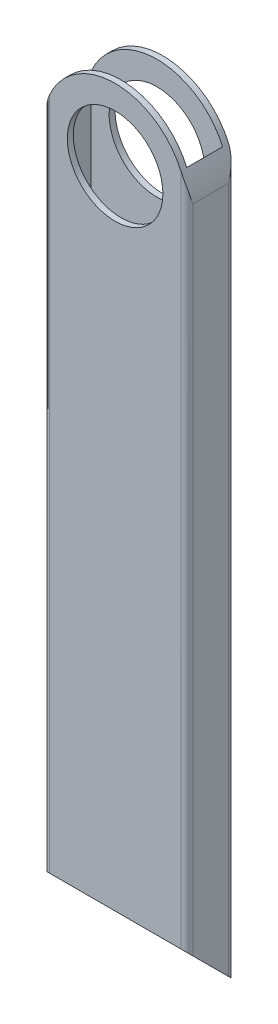
ISO-10303-21;
HEADER;
FILE_DESCRIPTION(('STEP AP214'),'2;1');
FILE_NAME('part.step','',(''),(''),'','','');
FILE_SCHEMA(('AUTOMOTIVE_DESIGN { 1 0 10303 214 1 1 1 1 }'));
ENDSEC;
DATA;
#1=APPLICATION_CONTEXT('core data for automotive mechanical design processes');
#2=APPLICATION_PROTOCOL_DEFINITION('international standard','automotive_design',2000,#1);
#3=PRODUCT_CONTEXT('',#1,'mechanical');
#4=PRODUCT('Part','Part','',(#3));
#5=PRODUCT_RELATED_PRODUCT_CATEGORY('part','',(#4));
#6=PRODUCT_DEFINITION_FORMATION('','',#4);
#7=PRODUCT_DEFINITION_CONTEXT('part definition',#1,'design');
#8=PRODUCT_DEFINITION('design','',#6,#7);
#9=PRODUCT_DEFINITION_SHAPE('','',#8);
#10=(LENGTH_UNIT() NAMED_UNIT(*) SI_UNIT(.MILLI.,.METRE.));
#11=(NAMED_UNIT(*) PLANE_ANGLE_UNIT() SI_UNIT($,.RADIAN.));
#12=(NAMED_UNIT(*) SI_UNIT($,.STERADIAN.) SOLID_ANGLE_UNIT());
#13=UNCERTAINTY_MEASURE_WITH_UNIT(LENGTH_MEASURE(1.E-05),#10,'distance_accuracy_value','');
#14=(GEOMETRIC_REPRESENTATION_CONTEXT(3) GLOBAL_UNCERTAINTY_ASSIGNED_CONTEXT((#13)) GLOBAL_UNIT_ASSIGNED_CONTEXT((#10,
#11,#12)) REPRESENTATION_CONTEXT('',''));
#15=CARTESIAN_POINT('',(0.,0.,0.));
#16=DIRECTION('',(0.,0.,1.));
#17=DIRECTION('',(1.,0.,0.));
#18=AXIS2_PLACEMENT_3D('',#15,#16,#17);
#19=CARTESIAN_POINT('',(38.1,203.2,-1.58750000000001));
#20=DIRECTION('',(-1.,0.,0.));
#21=DIRECTION('',(0.,0.,1.));
#22=AXIS2_PLACEMENT_3D('',#19,#20,#21);
#23=PLANE('',#22);
#24=DIRECTION('',(0.,-1.,0.));
#25=VECTOR('',#24,1.);
#26=CARTESIAN_POINT('',(38.1,203.2,-1.58750000000001));
#27=LINE('',#26,#25);
#28=CARTESIAN_POINT('',(38.1,184.15,-1.58750000000001));
#29=VERTEX_POINT('',#28);
#30=CARTESIAN_POINT('',(38.1,11.1125,-1.58749999999999));
#31=VERTEX_POINT('',#30);
#32=EDGE_CURVE('E162',#29,#31,#27,.T.);
#33=ORIENTED_EDGE('',*,*,#32,.T.);
#34=DIRECTION('',(0.,0.707106781186547,0.707106781186547));
#35=VECTOR('',#34,1.);
#36=CARTESIAN_POINT('',(38.1,0.,-12.7));
#37=LINE('',#36,#35);
#38=CARTESIAN_POINT('',(38.1,1.58750000000002,-11.1125));
#39=VERTEX_POINT('',#38);
#40=EDGE_CURVE('E305',#39,#31,#37,.T.);
#41=ORIENTED_EDGE('',*,*,#40,.F.);
#42=DIRECTION('',(0.,-1.,0.));
#43=VECTOR('',#42,1.);
#44=CARTESIAN_POINT('',(38.1,203.2,-11.1125));
#45=LINE('',#44,#43);
#46=CARTESIAN_POINT('',(38.1,184.15,-11.1125));
#47=VERTEX_POINT('',#46);
#48=EDGE_CURVE('E159',#47,#39,#45,.T.);
#49=ORIENTED_EDGE('',*,*,#48,.F.);
#50=DIRECTION('',(0.,0.,1.));
#51=VECTOR('',#50,1.);
#52=CARTESIAN_POINT('',(38.1,184.15,-12.7));
#53=LINE('',#52,#51);
#54=EDGE_CURVE('E279',#47,#29,#53,.T.);
#55=ORIENTED_EDGE('',*,*,#54,.T.);
#56=EDGE_LOOP('',(#33,#41,#49,#55));
#57=FACE_BOUND('',#56,.T.);
#58=ADVANCED_FACE('F34',(#57),#23,.F.);
#59=CARTESIAN_POINT('',(1.5875,203.2,-1.5875));
#60=DIRECTION('',(0.,-1.,0.));
#61=DIRECTION('',(0.,0.,-1.));
#62=AXIS2_PLACEMENT_3D('',#59,#60,#61);
#63=CYLINDRICAL_SURFACE('',#62,1.5875);
#64=DIRECTION('',(0.,-1.,0.));
#65=VECTOR('',#64,1.);
#66=CARTESIAN_POINT('',(0.,203.2,-1.58750000000001));
#67=LINE('',#66,#65);
#68=CARTESIAN_POINT('',(0.,184.15,-1.58750000000001));
#69=VERTEX_POINT('',#68);
#70=CARTESIAN_POINT('',(0.,11.1125,-1.5875));
#71=VERTEX_POINT('',#70);
#72=EDGE_CURVE('E147',#69,#71,#67,.T.);
#73=ORIENTED_EDGE('',*,*,#72,.T.);
#74=CARTESIAN_POINT('',(1.5875,11.1125,-1.5875));
#75=DIRECTION('',(0.,0.707106781186547,-0.707106781186547));
#76=DIRECTION('',(0.,-0.707106781186548,-0.707106781186548));
#77=AXIS2_PLACEMENT_3D('',#74,#75,#76);
#78=ELLIPSE('',#77,2.24506403026729,1.5875);
#79=CARTESIAN_POINT('',(1.58750000000001,12.7,0.));
#80=VERTEX_POINT('',#79);
#81=EDGE_CURVE('E50',#71,#80,#78,.T.);
#82=ORIENTED_EDGE('',*,*,#81,.T.);
#83=DIRECTION('',(0.,-1.,0.));
#84=VECTOR('',#83,1.);
#85=CARTESIAN_POINT('',(1.58750000000001,203.2,0.));
#86=LINE('',#85,#84);
#87=CARTESIAN_POINT('',(1.58750000000002,191.763382543259,0.));
#88=VERTEX_POINT('',#87);
#89=EDGE_CURVE('E168',#88,#80,#86,.T.);
#90=ORIENTED_EDGE('',*,*,#89,.F.);
#91=CARTESIAN_POINT('',(1.58750000000001,191.763382543259,0.));
#92=CARTESIAN_POINT('',(1.53376495818065,191.640138054539,-2.20127923181103E-05));
#93=CARTESIAN_POINT('',(1.48134884645403,191.51634677516,-0.00272721132376271));
#94=CARTESIAN_POINT('',(1.37922786128263,191.267887621081,-0.0128799698743036));
#95=CARTESIAN_POINT('',(1.32952209970535,191.143220048827,-0.0203259661579967));
#96=CARTESIAN_POINT('',(1.23293387376192,190.89333572705,-0.0393225552435428));
#97=CARTESIAN_POINT('',(1.18604719292055,190.768120114201,-0.0508668302049982));
#98=CARTESIAN_POINT('',(1.09503442027229,190.517067046557,-0.0775720070496662));
#99=CARTESIAN_POINT('',(1.05090859046153,190.391229533965,-0.0927332515169016));
#100=CARTESIAN_POINT('',(0.922969308448521,190.013760253545,-0.142875404943637));
#101=CARTESIAN_POINT('',(0.843273956192606,189.761342510137,-0.182583715714911));
#102=CARTESIAN_POINT('',(0.6948497185621,189.254962806347,-0.271890436384124));
#103=CARTESIAN_POINT('',(0.626126547519453,189.001000112359,-0.321493969678617));
#104=CARTESIAN_POINT('',(0.468855854744227,188.368445417287,-0.454385852694657));
#105=CARTESIAN_POINT('',(0.386872114640803,187.989180843358,-0.542339283056971));
#106=CARTESIAN_POINT('',(0.246538562115965,187.229249942017,-0.729781658305805));
#107=CARTESIAN_POINT('',(0.188193053211932,186.848583372079,-0.829272699464008));
#108=CARTESIAN_POINT('',(0.0480466292446869,185.704992539106,-1.1386101903998));
#109=CARTESIAN_POINT('',(0.00108140591264894,184.940255978614,-1.35937271393351));
#110=CARTESIAN_POINT('',(6.15744997773057E-06,184.167680800396,-1.58239601360152));
#111=CARTESIAN_POINT('',(3.88492361050782E-09,184.158840330417,-1.58494803783133));
#112=CARTESIAN_POINT('',(0.,184.15,-1.5875));
#113=B_SPLINE_CURVE_WITH_KNOTS('',3,(#91,#92,#93,#94,#95,#96,#97,#98,#99,#100,#101,#102,#103,
#104,#105,#106,#107,#108,#109,#110,#111,#112),.UNSPECIFIED.,.F.,.F.,(4,2,2,2,2,2,2,2,2,2,4),(0.,
0.403276855841871,0.806420761100367,1.20894586583019,1.6115091111792,2.41396604086429,
3.21683953784447,4.40933258199479,5.60204263099948,7.98676642553446,8.0143707791923),.UNSPECIFIED.);
#114=EDGE_CURVE('E200',#88,#69,#113,.T.);
#115=ORIENTED_EDGE('',*,*,#114,.T.);
#116=EDGE_LOOP('',(#73,#82,#90,#115));
#117=FACE_BOUND('',#116,.T.);
#118=ADVANCED_FACE('F36',(#117),#63,.T.);
#119=CARTESIAN_POINT('',(1.58750000000001,203.2,0.));
#120=DIRECTION('',(0.,0.,-1.));
#121=DIRECTION('',(-1.,0.,0.));
#122=AXIS2_PLACEMENT_3D('',#119,#120,#121);
#123=PLANE('',#122);
#124=CARTESIAN_POINT('',(19.05,184.15,0.));
#125=DIRECTION('',(0.,0.,1.));
#126=DIRECTION('',(1.,0.,0.));
#127=AXIS2_PLACEMENT_3D('',#124,#125,#126);
#128=CIRCLE('',#127,12.7);
#129=CARTESIAN_POINT('',(31.75,184.15,0.));
#130=VERTEX_POINT('',#129);
#131=EDGE_CURVE('E263',#130,#130,#128,.T.);
#132=ORIENTED_EDGE('',*,*,#131,.F.);
#133=EDGE_LOOP('',(#132));
#134=FACE_BOUND('',#133,.T.);
#135=ORIENTED_EDGE('',*,*,#89,.T.);
#136=DIRECTION('',(1.,0.,0.));
#137=VECTOR('',#136,1.);
#138=CARTESIAN_POINT('',(0.,12.7,0.));
#139=LINE('',#138,#137);
#140=CARTESIAN_POINT('',(36.5125,12.7,0.));
#141=VERTEX_POINT('',#140);
#142=EDGE_CURVE('E267',#80,#141,#139,.T.);
#143=ORIENTED_EDGE('',*,*,#142,.T.);
#144=DIRECTION('',(0.,-1.,0.));
#145=VECTOR('',#144,1.);
#146=CARTESIAN_POINT('',(36.5125,203.2,0.));
#147=LINE('',#146,#145);
#148=CARTESIAN_POINT('',(36.5125,191.763382543259,0.));
#149=VERTEX_POINT('',#148);
#150=EDGE_CURVE('E165',#149,#141,#147,.T.);
#151=ORIENTED_EDGE('',*,*,#150,.F.);
#152=CARTESIAN_POINT('',(19.05,184.15,0.));
#153=DIRECTION('',(0.,0.,-1.));
#154=DIRECTION('',(-1.,0.,0.));
#155=AXIS2_PLACEMENT_3D('',#152,#153,#154);
#156=CIRCLE('',#155,19.05);
#157=EDGE_CURVE('E268',#88,#149,#156,.T.);
#158=ORIENTED_EDGE('',*,*,#157,.F.);
#159=EDGE_LOOP('',(#135,#143,#151,#158));
#160=FACE_BOUND('',#159,.T.);
#161=ADVANCED_FACE('F252',(#134,#160),#123,.F.);
#162=CARTESIAN_POINT('',(36.5125,203.2,-1.5875));
#163=DIRECTION('',(0.,-1.,0.));
#164=DIRECTION('',(0.,0.,-1.));
#165=AXIS2_PLACEMENT_3D('',#162,#163,#164);
#166=CYLINDRICAL_SURFACE('',#165,1.5875);
#167=ORIENTED_EDGE('',*,*,#150,.T.);
#168=CARTESIAN_POINT('',(36.5125,11.1125,-1.5875));
#169=DIRECTION('',(0.,0.707106781186547,-0.707106781186547));
#170=DIRECTION('',(0.,-0.707106781186548,-0.707106781186548));
#171=AXIS2_PLACEMENT_3D('',#168,#169,#170);
#172=ELLIPSE('',#171,2.24506403026729,1.5875);
#173=EDGE_CURVE('E271',#141,#31,#172,.T.);
#174=ORIENTED_EDGE('',*,*,#173,.T.);
#175=ORIENTED_EDGE('',*,*,#32,.F.);
#176=CARTESIAN_POINT('',(36.5125,191.763382543259,0.));
#177=CARTESIAN_POINT('',(36.5662350418193,191.640138054539,-2.20127923186478E-05));
#178=CARTESIAN_POINT('',(36.618651153546,191.51634677516,-0.00272721132376353));
#179=CARTESIAN_POINT('',(36.7207721387174,191.267887621081,-0.0128799698743059));
#180=CARTESIAN_POINT('',(36.7704779002947,191.143220048827,-0.0203259661580004));
#181=CARTESIAN_POINT('',(36.8670661262381,190.89333572705,-0.0393225552435498));
#182=CARTESIAN_POINT('',(36.9139528070795,190.768120114201,-0.0508668302050063));
#183=CARTESIAN_POINT('',(37.0049655797277,190.517067046557,-0.0775720070496772));
#184=CARTESIAN_POINT('',(37.0490914095385,190.391229533965,-0.0927332515169146));
#185=CARTESIAN_POINT('',(37.1770306915515,190.013760253544,-0.142875404943651));
#186=CARTESIAN_POINT('',(37.2567260438074,189.761342510137,-0.182583715714923));
#187=CARTESIAN_POINT('',(37.4051502814379,189.254962806347,-0.271890436384127));
#188=CARTESIAN_POINT('',(37.4738734524806,189.001000112359,-0.321493969678612));
#189=CARTESIAN_POINT('',(37.6311441452558,188.368445417287,-0.454385852694663));
#190=CARTESIAN_POINT('',(37.7131278853592,187.989180843358,-0.542339283057008));
#191=CARTESIAN_POINT('',(37.853461437884,187.229249942017,-0.729781658305762));
#192=CARTESIAN_POINT('',(37.9118069467881,186.848583372079,-0.829272699463855));
#193=CARTESIAN_POINT('',(38.0519533707553,185.704992539107,-1.13861019040006));
#194=CARTESIAN_POINT('',(38.0989185940874,184.940255978615,-1.35937271393502));
#195=CARTESIAN_POINT('',(38.09999384255,184.167680800396,-1.58239601360154));
#196=CARTESIAN_POINT('',(38.0999999961151,184.158840330417,-1.58494803783134));
#197=CARTESIAN_POINT('',(38.1,184.15,-1.5875));
#198=B_SPLINE_CURVE_WITH_KNOTS('',3,(#176,#177,#178,#179,#180,#181,#182,#183,#184,#185,#186,
#187,#188,#189,#190,#191,#192,#193,#194,#195,#196,#197),.UNSPECIFIED.,.F.,.F.,(4,2,2,2,2,2,2,2,
2,2,4),(0.,0.403276855841901,0.806420761100455,1.20894586583028,1.61150911117932,
2.41396604086432,3.21683953784447,4.40933258199476,5.60204263099942,7.98676642553439,
8.0143707791923),.UNSPECIFIED.);
#199=EDGE_CURVE('E210',#29,#149,#198,.F.);
#200=ORIENTED_EDGE('',*,*,#199,.T.);
#201=EDGE_LOOP('',(#167,#174,#175,#200));
#202=FACE_BOUND('',#201,.T.);
#203=ADVANCED_FACE('F246',(#202),#166,.T.);
#204=CARTESIAN_POINT('',(36.5125,203.2,-11.1125));
#205=DIRECTION('',(0.,-1.,0.));
#206=DIRECTION('',(0.,0.,-1.));
#207=AXIS2_PLACEMENT_3D('',#204,#205,#206);
#208=CYLINDRICAL_SURFACE('',#207,1.5875);
#209=ORIENTED_EDGE('',*,*,#48,.T.);
#210=CARTESIAN_POINT('',(36.5125,1.58750000000002,-11.1125));
#211=DIRECTION('',(0.,0.707106781186547,-0.707106781186547));
#212=DIRECTION('',(0.,-0.707106781186548,-0.707106781186548));
#213=AXIS2_PLACEMENT_3D('',#210,#211,#212);
#214=ELLIPSE('',#213,2.24506403026729,1.5875);
#215=CARTESIAN_POINT('',(36.5125,0.,-12.7));
#216=VERTEX_POINT('',#215);
#217=EDGE_CURVE('E131',#39,#216,#214,.T.);
#218=ORIENTED_EDGE('',*,*,#217,.T.);
#219=DIRECTION('',(0.,-1.,0.));
#220=VECTOR('',#219,1.);
#221=CARTESIAN_POINT('',(36.5125,203.2,-12.7));
#222=LINE('',#221,#220);
#223=CARTESIAN_POINT('',(36.5125,191.763382543259,-12.7));
#224=VERTEX_POINT('',#223);
#225=EDGE_CURVE('E141',#224,#216,#222,.T.);
#226=ORIENTED_EDGE('',*,*,#225,.F.);
#227=CARTESIAN_POINT('',(36.5125,191.763382543259,-12.7));
#228=CARTESIAN_POINT('',(36.5662350418193,191.640138054539,-12.6999779872077));
#229=CARTESIAN_POINT('',(36.618651153546,191.51634677516,-12.6972727886762));
#230=CARTESIAN_POINT('',(36.7207721387174,191.267887621081,-12.6871200301257));
#231=CARTESIAN_POINT('',(36.7704779002946,191.143220048827,-12.679674033842));
#232=CARTESIAN_POINT('',(36.8670661262381,190.89333572705,-12.6606774447565));
#233=CARTESIAN_POINT('',(36.9139528070794,190.768120114201,-12.649133169795));
#234=CARTESIAN_POINT('',(37.0049655797277,190.517067046557,-12.6224279929503));
#235=CARTESIAN_POINT('',(37.0490914095384,190.391229533965,-12.6072667484831));
#236=CARTESIAN_POINT('',(37.1770306915515,190.013760253545,-12.5571245950564));
#237=CARTESIAN_POINT('',(37.2567260438074,189.761342510137,-12.5174162842851));
#238=CARTESIAN_POINT('',(37.4051502814379,189.254962806347,-12.4281095636159));
#239=CARTESIAN_POINT('',(37.4738734524805,189.001000112359,-12.3785060303214));
#240=CARTESIAN_POINT('',(37.6311441452558,188.368445417287,-12.2456141473054));
#241=CARTESIAN_POINT('',(37.7131278853592,187.989180843358,-12.1576607169431));
#242=CARTESIAN_POINT('',(37.853461437884,187.229249942017,-11.9702183416942));
#243=CARTESIAN_POINT('',(37.9118069467881,186.848583372079,-11.8707273005358));
#244=CARTESIAN_POINT('',(38.0519533707553,185.704992539106,-11.5613898096005));
#245=CARTESIAN_POINT('',(38.0989185940874,184.940255978614,-11.3406272860681));
#246=CARTESIAN_POINT('',(38.09999384255,184.167680800396,-11.1176039863985));
#247=CARTESIAN_POINT('',(38.0999999961151,184.158840330417,-11.1150519621687));
#248=CARTESIAN_POINT('',(38.1,184.15,-11.1125));
#249=B_SPLINE_CURVE_WITH_KNOTS('',3,(#227,#228,#229,#230,#231,#232,#233,#234,#235,#236,#237,
#238,#239,#240,#241,#242,#243,#244,#245,#246,#247,#248),.UNSPECIFIED.,.F.,.F.,(4,2,2,2,2,2,2,2,
2,2,4),(0.,0.403276855841873,0.806420761100337,1.20894586583014,1.61150911117911,
2.4139660408642,3.21683953784447,4.40933258199478,5.60204263099946,7.98676642553438,
8.0143707791923),.UNSPECIFIED.);
#250=EDGE_CURVE('E234',#224,#47,#249,.T.);
#251=ORIENTED_EDGE('',*,*,#250,.T.);
#252=EDGE_LOOP('',(#209,#218,#226,#251));
#253=FACE_BOUND('',#252,.T.);
#254=ADVANCED_FACE('F241',(#253),#208,.T.);
#255=CARTESIAN_POINT('',(1.58750000000001,203.2,-12.7));
#256=DIRECTION('',(0.,0.,1.));
#257=DIRECTION('',(1.,0.,0.));
#258=AXIS2_PLACEMENT_3D('',#255,#256,#257);
#259=PLANE('',#258);
#260=CARTESIAN_POINT('',(19.05,184.15,-12.7));
#261=DIRECTION('',(0.,0.,1.));
#262=DIRECTION('',(1.,0.,0.));
#263=AXIS2_PLACEMENT_3D('',#260,#261,#262);
#264=CIRCLE('',#263,12.7);
#265=CARTESIAN_POINT('',(31.75,184.15,-12.7));
#266=VERTEX_POINT('',#265);
#267=EDGE_CURVE('E174',#266,#266,#264,.T.);
#268=ORIENTED_EDGE('',*,*,#267,.T.);
#269=EDGE_LOOP('',(#268));
#270=FACE_BOUND('',#269,.T.);
#271=DIRECTION('',(0.,-1.,0.));
#272=VECTOR('',#271,1.);
#273=CARTESIAN_POINT('',(1.58750000000001,203.2,-12.7));
#274=LINE('',#273,#272);
#275=CARTESIAN_POINT('',(1.5875,191.763382543259,-12.7));
#276=VERTEX_POINT('',#275);
#277=CARTESIAN_POINT('',(1.5875,0.,-12.7));
#278=VERTEX_POINT('',#277);
#279=EDGE_CURVE('E136',#276,#278,#274,.T.);
#280=ORIENTED_EDGE('',*,*,#279,.F.);
#281=CARTESIAN_POINT('',(19.05,184.15,-12.7));
#282=DIRECTION('',(0.,0.,-1.));
#283=DIRECTION('',(-1.,0.,0.));
#284=AXIS2_PLACEMENT_3D('',#281,#282,#283);
#285=CIRCLE('',#284,19.05);
#286=EDGE_CURVE('E273',#276,#224,#285,.T.);
#287=ORIENTED_EDGE('',*,*,#286,.T.);
#288=ORIENTED_EDGE('',*,*,#225,.T.);
#289=DIRECTION('',(-1.,0.,0.));
#290=VECTOR('',#289,1.);
#291=CARTESIAN_POINT('',(1.58750000000001,0.,-12.7));
#292=LINE('',#291,#290);
#293=EDGE_CURVE('E125',#216,#278,#292,.T.);
#294=ORIENTED_EDGE('',*,*,#293,.T.);
#295=EDGE_LOOP('',(#280,#287,#288,#294));
#296=FACE_BOUND('',#295,.T.);
#297=ADVANCED_FACE('F145',(#270,#296),#259,.F.);
#298=CARTESIAN_POINT('',(1.5875,203.2,-11.1125));
#299=DIRECTION('',(0.,-1.,0.));
#300=DIRECTION('',(0.,0.,-1.));
#301=AXIS2_PLACEMENT_3D('',#298,#299,#300);
#302=CYLINDRICAL_SURFACE('',#301,1.5875);
#303=ORIENTED_EDGE('',*,*,#279,.T.);
#304=CARTESIAN_POINT('',(1.5875,1.58750000000002,-11.1125));
#305=DIRECTION('',(0.,0.707106781186547,-0.707106781186547));
#306=DIRECTION('',(0.,-0.707106781186548,-0.707106781186548));
#307=AXIS2_PLACEMENT_3D('',#304,#305,#306);
#308=ELLIPSE('',#307,2.24506403026729,1.5875);
#309=CARTESIAN_POINT('',(0.,1.5875,-11.1125));
#310=VERTEX_POINT('',#309);
#311=EDGE_CURVE('E121',#278,#310,#308,.T.);
#312=ORIENTED_EDGE('',*,*,#311,.T.);
#313=DIRECTION('',(0.,-1.,0.));
#314=VECTOR('',#313,1.);
#315=CARTESIAN_POINT('',(0.,203.2,-11.1125));
#316=LINE('',#315,#314);
#317=CARTESIAN_POINT('',(0.,184.15,-11.1125));
#318=VERTEX_POINT('',#317);
#319=EDGE_CURVE('E142',#318,#310,#316,.T.);
#320=ORIENTED_EDGE('',*,*,#319,.F.);
#321=CARTESIAN_POINT('',(1.58750000000001,191.763382543259,-12.7));
#322=CARTESIAN_POINT('',(1.53376495818056,191.640138054538,-12.6999779872077));
#323=CARTESIAN_POINT('',(1.48134884645384,191.51634677516,-12.6972727886762));
#324=CARTESIAN_POINT('',(1.37922786128227,191.26788762108,-12.6871200301257));
#325=CARTESIAN_POINT('',(1.32952209970491,191.143220048826,-12.6796740338419));
#326=CARTESIAN_POINT('',(1.23293387376135,190.893335727049,-12.6606774447563));
#327=CARTESIAN_POINT('',(1.18604719291993,190.768120114199,-12.6491331697948));
#328=CARTESIAN_POINT('',(1.09503442027157,190.517067046555,-12.6224279929501));
#329=CARTESIAN_POINT('',(1.05090859046076,190.391229533963,-12.6072667484828));
#330=CARTESIAN_POINT('',(0.922969308447896,190.013760253543,-12.5571245950561));
#331=CARTESIAN_POINT('',(0.843273956192143,189.761342510136,-12.5174162842848));
#332=CARTESIAN_POINT('',(0.694849718561904,189.254962806346,-12.4281095636158));
#333=CARTESIAN_POINT('',(0.626126547519364,189.001000112359,-12.3785060303214));
#334=CARTESIAN_POINT('',(0.468855854744242,188.368445417288,-12.2456141473052));
#335=CARTESIAN_POINT('',(0.386872114640826,187.989180843358,-12.1576607169423));
#336=CARTESIAN_POINT('',(0.246538562116026,187.229249942017,-11.9702183416951));
#337=CARTESIAN_POINT('',(0.188193053212019,186.848583372078,-11.8707273005391));
#338=CARTESIAN_POINT('',(0.0480466292446686,185.704992539109,-11.5613898095944));
#339=CARTESIAN_POINT('',(0.00108140591244265,184.940255978624,-11.3406272860341));
#340=CARTESIAN_POINT('',(6.15744997511764E-06,184.167680800396,-11.1176039863977));
#341=CARTESIAN_POINT('',(3.88492337993301E-09,184.158840330417,-11.1150519621683));
#342=CARTESIAN_POINT('',(0.,184.15,-11.1125));
#343=B_SPLINE_CURVE_WITH_KNOTS('',3,(#321,#322,#323,#324,#325,#326,#327,#328,#329,#330,#331,
#332,#333,#334,#335,#336,#337,#338,#339,#340,#341,#342),.UNSPECIFIED.,.F.,.F.,(4,2,2,2,2,2,2,2,
2,2,4),(0.,0.403276855842592,0.806420761101797,1.20894586583218,1.61150911118171,
2.41396604086543,3.21683953784447,4.40933258199458,5.60204263099885,7.98676642553452,
8.0143707791923),.UNSPECIFIED.);
#344=EDGE_CURVE('E138',#318,#276,#343,.F.);
#345=ORIENTED_EDGE('',*,*,#344,.T.);
#346=EDGE_LOOP('',(#303,#312,#320,#345));
#347=FACE_BOUND('',#346,.T.);
#348=ADVANCED_FACE('F137',(#347),#302,.T.);
#349=CARTESIAN_POINT('',(0.,203.2,-1.58750000000001));
#350=DIRECTION('',(1.,0.,0.));
#351=DIRECTION('',(0.,0.,-1.));
#352=AXIS2_PLACEMENT_3D('',#349,#350,#351);
#353=PLANE('',#352);
#354=ORIENTED_EDGE('',*,*,#319,.T.);
#355=DIRECTION('',(0.,0.707106781186547,0.707106781186547));
#356=VECTOR('',#355,1.);
#357=CARTESIAN_POINT('',(0.,0.,-12.7));
#358=LINE('',#357,#356);
#359=EDGE_CURVE('E127',#310,#71,#358,.T.);
#360=ORIENTED_EDGE('',*,*,#359,.T.);
#361=ORIENTED_EDGE('',*,*,#72,.F.);
#362=DIRECTION('',(0.,0.,1.));
#363=VECTOR('',#362,1.);
#364=CARTESIAN_POINT('',(0.,184.15,-12.7));
#365=LINE('',#364,#363);
#366=EDGE_CURVE('E281',#318,#69,#365,.T.);
#367=ORIENTED_EDGE('',*,*,#366,.F.);
#368=EDGE_LOOP('',(#354,#360,#361,#367));
#369=FACE_BOUND('',#368,.T.);
#370=ADVANCED_FACE('F310',(#369),#353,.F.);
#371=CARTESIAN_POINT('',(1.5875,203.2,-1.5875));
#372=DIRECTION('',(1.,0.,0.));
#373=DIRECTION('',(0.,0.,-1.));
#374=AXIS2_PLACEMENT_3D('',#371,#372,#373);
#375=PLANE('',#374);
#376=DIRECTION('',(0.,0.707106781186548,0.707106781186548));
#377=VECTOR('',#376,1.);
#378=CARTESIAN_POINT('',(1.5875,107.15625,94.45625));
#379=LINE('',#378,#377);
#380=CARTESIAN_POINT('',(1.5875,1.58750000000002,-11.1125));
#381=VERTEX_POINT('',#380);
#382=CARTESIAN_POINT('',(1.5875,11.1125,-1.5875));
#383=VERTEX_POINT('',#382);
#384=EDGE_CURVE('E132',#381,#383,#379,.T.);
#385=ORIENTED_EDGE('',*,*,#384,.F.);
#386=DIRECTION('',(0.,-1.,0.));
#387=VECTOR('',#386,1.);
#388=CARTESIAN_POINT('',(1.5875,203.2,-11.1125));
#389=LINE('',#388,#387);
#390=CARTESIAN_POINT('',(1.5875,191.763382543259,-11.1125));
#391=VERTEX_POINT('',#390);
#392=EDGE_CURVE('E198',#391,#381,#389,.T.);
#393=ORIENTED_EDGE('',*,*,#392,.F.);
#394=DIRECTION('',(0.,0.,1.));
#395=VECTOR('',#394,1.);
#396=CARTESIAN_POINT('',(1.5875,191.763382543259,-12.7));
#397=LINE('',#396,#395);
#398=CARTESIAN_POINT('',(1.5875,191.763382543259,-1.5875));
#399=VERTEX_POINT('',#398);
#400=EDGE_CURVE('E183',#399,#391,#397,.F.);
#401=ORIENTED_EDGE('',*,*,#400,.F.);
#402=DIRECTION('',(0.,-1.,0.));
#403=VECTOR('',#402,1.);
#404=CARTESIAN_POINT('',(1.5875,203.2,-1.5875));
#405=LINE('',#404,#403);
#406=EDGE_CURVE('E148',#399,#383,#405,.T.);
#407=ORIENTED_EDGE('',*,*,#406,.T.);
#408=EDGE_LOOP('',(#385,#393,#401,#407));
#409=FACE_BOUND('',#408,.T.);
#410=ADVANCED_FACE('F294',(#409),#375,.T.);
#411=CARTESIAN_POINT('',(1.5875,203.2,-1.5875));
#412=DIRECTION('',(0.,0.,-1.));
#413=DIRECTION('',(-1.,0.,0.));
#414=AXIS2_PLACEMENT_3D('',#411,#412,#413);
#415=PLANE('',#414);
#416=DIRECTION('',(1.,0.,0.));
#417=VECTOR('',#416,1.);
#418=CARTESIAN_POINT('',(1.5875,11.1125,-1.5875));
#419=LINE('',#418,#417);
#420=CARTESIAN_POINT('',(36.5125,11.1125,-1.58750000000001));
#421=VERTEX_POINT('',#420);
#422=EDGE_CURVE('E298',#383,#421,#419,.T.);
#423=ORIENTED_EDGE('',*,*,#422,.F.);
#424=ORIENTED_EDGE('',*,*,#406,.F.);
#425=CARTESIAN_POINT('',(19.05,184.15,-1.5875));
#426=DIRECTION('',(0.,0.,-1.));
#427=DIRECTION('',(-1.,0.,0.));
#428=AXIS2_PLACEMENT_3D('',#425,#426,#427);
#429=CIRCLE('',#428,19.05);
#430=CARTESIAN_POINT('',(36.5125,191.763382543259,-1.5875));
#431=VERTEX_POINT('',#430);
#432=EDGE_CURVE('E194',#431,#399,#429,.F.);
#433=ORIENTED_EDGE('',*,*,#432,.F.);
#434=DIRECTION('',(0.,-1.,0.));
#435=VECTOR('',#434,1.);
#436=CARTESIAN_POINT('',(36.5125,203.2,-1.5875));
#437=LINE('',#436,#435);
#438=EDGE_CURVE('E153',#431,#421,#437,.T.);
#439=ORIENTED_EDGE('',*,*,#438,.T.);
#440=EDGE_LOOP('',(#423,#424,#433,#439));
#441=FACE_BOUND('',#440,.T.);
#442=CARTESIAN_POINT('',(19.05,184.15,-1.5875));
#443=DIRECTION('',(0.,0.,-1.));
#444=DIRECTION('',(-1.,0.,0.));
#445=AXIS2_PLACEMENT_3D('',#442,#443,#444);
#446=CIRCLE('',#445,12.7);
#447=CARTESIAN_POINT('',(6.35,184.15,-1.5875));
#448=VERTEX_POINT('',#447);
#449=EDGE_CURVE('E173',#448,#448,#446,.T.);
#450=ORIENTED_EDGE('',*,*,#449,.F.);
#451=EDGE_LOOP('',(#450));
#452=FACE_BOUND('',#451,.T.);
#453=ADVANCED_FACE('F296',(#441,#452),#415,.T.);
#454=CARTESIAN_POINT('',(36.5125,203.2,-1.5875));
#455=DIRECTION('',(-1.,0.,0.));
#456=DIRECTION('',(0.,0.,1.));
#457=AXIS2_PLACEMENT_3D('',#454,#455,#456);
#458=PLANE('',#457);
#459=DIRECTION('',(0.,-0.707106781186548,-0.707106781186548));
#460=VECTOR('',#459,1.);
#461=CARTESIAN_POINT('',(36.5125,107.15625,94.45625));
#462=LINE('',#461,#460);
#463=CARTESIAN_POINT('',(36.5125,1.58750000000002,-11.1125));
#464=VERTEX_POINT('',#463);
#465=EDGE_CURVE('E57',#421,#464,#462,.T.);
#466=ORIENTED_EDGE('',*,*,#465,.F.);
#467=ORIENTED_EDGE('',*,*,#438,.F.);
#468=DIRECTION('',(0.,0.,1.));
#469=VECTOR('',#468,1.);
#470=CARTESIAN_POINT('',(36.5125,191.763382543259,-12.7));
#471=LINE('',#470,#469);
#472=CARTESIAN_POINT('',(36.5125,191.763382543259,-11.1125));
#473=VERTEX_POINT('',#472);
#474=EDGE_CURVE('E180',#473,#431,#471,.T.);
#475=ORIENTED_EDGE('',*,*,#474,.F.);
#476=DIRECTION('',(0.,-1.,0.));
#477=VECTOR('',#476,1.);
#478=CARTESIAN_POINT('',(36.5125,203.2,-11.1125));
#479=LINE('',#478,#477);
#480=EDGE_CURVE('E192',#473,#464,#479,.T.);
#481=ORIENTED_EDGE('',*,*,#480,.T.);
#482=EDGE_LOOP('',(#466,#467,#475,#481));
#483=FACE_BOUND('',#482,.T.);
#484=ADVANCED_FACE('F191',(#483),#458,.T.);
#485=CARTESIAN_POINT('',(1.5875,203.2,-11.1125));
#486=DIRECTION('',(0.,0.,1.));
#487=DIRECTION('',(1.,0.,0.));
#488=AXIS2_PLACEMENT_3D('',#485,#486,#487);
#489=PLANE('',#488);
#490=DIRECTION('',(-1.,0.,0.));
#491=VECTOR('',#490,1.);
#492=CARTESIAN_POINT('',(1.58750000000004,1.58750000000002,-11.1125));
#493=LINE('',#492,#491);
#494=EDGE_CURVE('E11',#464,#381,#493,.T.);
#495=ORIENTED_EDGE('',*,*,#494,.F.);
#496=ORIENTED_EDGE('',*,*,#480,.F.);
#497=CARTESIAN_POINT('',(19.05,184.15,-11.1125));
#498=DIRECTION('',(0.,0.,1.));
#499=DIRECTION('',(1.,0.,0.));
#500=AXIS2_PLACEMENT_3D('',#497,#498,#499);
#501=CIRCLE('',#500,19.05);
#502=EDGE_CURVE('E43',#391,#473,#501,.F.);
#503=ORIENTED_EDGE('',*,*,#502,.F.);
#504=ORIENTED_EDGE('',*,*,#392,.T.);
#505=EDGE_LOOP('',(#495,#496,#503,#504));
#506=FACE_BOUND('',#505,.T.);
#507=CARTESIAN_POINT('',(19.05,184.15,-11.1125));
#508=DIRECTION('',(0.,0.,1.));
#509=DIRECTION('',(1.,0.,0.));
#510=AXIS2_PLACEMENT_3D('',#507,#508,#509);
#511=CIRCLE('',#510,12.7);
#512=CARTESIAN_POINT('',(31.75,184.15,-11.1125));
#513=VERTEX_POINT('',#512);
#514=EDGE_CURVE('E171',#513,#513,#511,.T.);
#515=ORIENTED_EDGE('',*,*,#514,.F.);
#516=EDGE_LOOP('',(#515));
#517=FACE_BOUND('',#516,.T.);
#518=ADVANCED_FACE('F196',(#506,#517),#489,.T.);
#519=CARTESIAN_POINT('',(19.05,184.15,-12.7));
#520=DIRECTION('',(0.,0.,1.));
#521=DIRECTION('',(1.,0.,0.));
#522=AXIS2_PLACEMENT_3D('',#519,#520,#521);
#523=CYLINDRICAL_SURFACE('',#522,12.7);
#524=ORIENTED_EDGE('',*,*,#514,.T.);
#525=EDGE_LOOP('',(#524));
#526=FACE_BOUND('',#525,.T.);
#527=ORIENTED_EDGE('',*,*,#267,.F.);
#528=EDGE_LOOP('',(#527));
#529=FACE_BOUND('',#528,.T.);
#530=ADVANCED_FACE('F222',(#526,#529),#523,.F.);
#531=CARTESIAN_POINT('',(19.05,184.15,-12.7));
#532=DIRECTION('',(0.,0.,1.));
#533=DIRECTION('',(1.,0.,0.));
#534=AXIS2_PLACEMENT_3D('',#531,#532,#533);
#535=CYLINDRICAL_SURFACE('',#534,19.05);
#536=ORIENTED_EDGE('',*,*,#432,.T.);
#537=ORIENTED_EDGE('',*,*,#400,.T.);
#538=ORIENTED_EDGE('',*,*,#502,.T.);
#539=ORIENTED_EDGE('',*,*,#474,.T.);
#540=EDGE_LOOP('',(#536,#537,#538,#539));
#541=FACE_BOUND('',#540,.T.);
#542=ORIENTED_EDGE('',*,*,#114,.F.);
#543=ORIENTED_EDGE('',*,*,#157,.T.);
#544=ORIENTED_EDGE('',*,*,#199,.F.);
#545=ORIENTED_EDGE('',*,*,#54,.F.);
#546=ORIENTED_EDGE('',*,*,#250,.F.);
#547=ORIENTED_EDGE('',*,*,#286,.F.);
#548=ORIENTED_EDGE('',*,*,#344,.F.);
#549=ORIENTED_EDGE('',*,*,#366,.T.);
#550=EDGE_LOOP('',(#542,#543,#544,#545,#546,#547,#548,#549));
#551=FACE_BOUND('',#550,.T.);
#552=ADVANCED_FACE('F178',(#541,#551),#535,.T.);
#553=ORIENTED_EDGE('',*,*,#449,.T.);
#554=EDGE_LOOP('',(#553));
#555=FACE_BOUND('',#554,.T.);
#556=ORIENTED_EDGE('',*,*,#131,.T.);
#557=EDGE_LOOP('',(#556));
#558=FACE_BOUND('',#557,.T.);
#559=ADVANCED_FACE('F221',(#555,#558),#523,.F.);
#560=CARTESIAN_POINT('',(0.,0.,-12.7));
#561=DIRECTION('',(0.,0.707106781186547,-0.707106781186547));
#562=DIRECTION('',(0.,0.707106781186548,0.707106781186548));
#563=AXIS2_PLACEMENT_3D('',#560,#561,#562);
#564=PLANE('',#563);
#565=ORIENTED_EDGE('',*,*,#384,.T.);
#566=ORIENTED_EDGE('',*,*,#422,.T.);
#567=ORIENTED_EDGE('',*,*,#465,.T.);
#568=ORIENTED_EDGE('',*,*,#494,.T.);
#569=EDGE_LOOP('',(#565,#566,#567,#568));
#570=FACE_BOUND('',#569,.T.);
#571=ORIENTED_EDGE('',*,*,#359,.F.);
#572=ORIENTED_EDGE('',*,*,#311,.F.);
#573=ORIENTED_EDGE('',*,*,#293,.F.);
#574=ORIENTED_EDGE('',*,*,#217,.F.);
#575=ORIENTED_EDGE('',*,*,#40,.T.);
#576=ORIENTED_EDGE('',*,*,#173,.F.);
#577=ORIENTED_EDGE('',*,*,#142,.F.);
#578=ORIENTED_EDGE('',*,*,#81,.F.);
#579=EDGE_LOOP('',(#571,#572,#573,#574,#575,#576,#577,#578));
#580=FACE_BOUND('',#579,.T.);
#581=ADVANCED_FACE('F123',(#570,#580),#564,.F.);
#582=CLOSED_SHELL('',(#58,#118,#161,#203,#254,#297,#348,#370,#410,#453,#484,#518,#530,#552,#559,#581));
#583=MANIFOLD_SOLID_BREP('B2',#582);
#584=ADVANCED_BREP_SHAPE_REPRESENTATION('',(#18,#583),#14);
#585=SHAPE_DEFINITION_REPRESENTATION(#9,#584);
ENDSEC;
END-ISO-10303-21;
